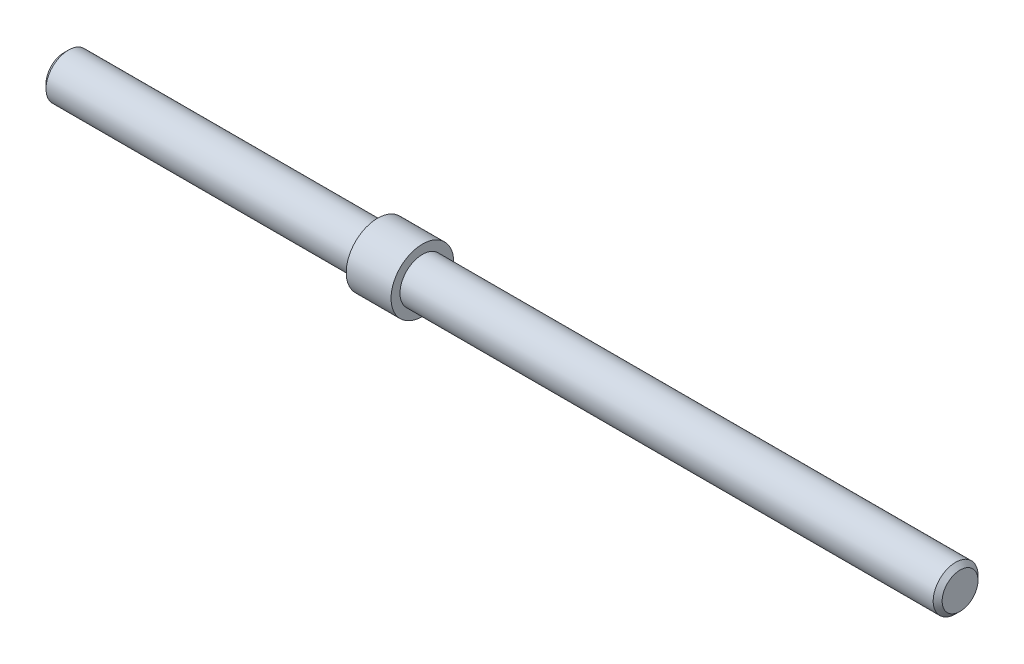
ISO-10303-21;
HEADER;
FILE_DESCRIPTION(('STEP AP214'),'2;1');
FILE_NAME('part.step','',(''),(''),'','','');
FILE_SCHEMA(('AUTOMOTIVE_DESIGN { 1 0 10303 214 1 1 1 1 }'));
ENDSEC;
DATA;
#1=APPLICATION_CONTEXT('core data for automotive mechanical design processes');
#2=APPLICATION_PROTOCOL_DEFINITION('international standard','automotive_design',2000,#1);
#3=PRODUCT_CONTEXT('',#1,'mechanical');
#4=PRODUCT('Part','Part','',(#3));
#5=PRODUCT_RELATED_PRODUCT_CATEGORY('part','',(#4));
#6=PRODUCT_DEFINITION_FORMATION('','',#4);
#7=PRODUCT_DEFINITION_CONTEXT('part definition',#1,'design');
#8=PRODUCT_DEFINITION('design','',#6,#7);
#9=PRODUCT_DEFINITION_SHAPE('','',#8);
#10=(LENGTH_UNIT() NAMED_UNIT(*) SI_UNIT(.MILLI.,.METRE.));
#11=(NAMED_UNIT(*) PLANE_ANGLE_UNIT() SI_UNIT($,.RADIAN.));
#12=(NAMED_UNIT(*) SI_UNIT($,.STERADIAN.) SOLID_ANGLE_UNIT());
#13=UNCERTAINTY_MEASURE_WITH_UNIT(LENGTH_MEASURE(1.E-05),#10,'distance_accuracy_value','');
#14=(GEOMETRIC_REPRESENTATION_CONTEXT(3) GLOBAL_UNCERTAINTY_ASSIGNED_CONTEXT((#13)) GLOBAL_UNIT_ASSIGNED_CONTEXT((#10,
#11,#12)) REPRESENTATION_CONTEXT('',''));
#15=CARTESIAN_POINT('',(0.,0.,0.));
#16=DIRECTION('',(0.,0.,1.));
#17=DIRECTION('',(1.,0.,0.));
#18=AXIS2_PLACEMENT_3D('',#15,#16,#17);
#19=CARTESIAN_POINT('',(200.,0.,0.));
#20=DIRECTION('',(-1.,0.,0.));
#21=DIRECTION('',(0.,0.,1.));
#22=AXIS2_PLACEMENT_3D('',#19,#20,#21);
#23=CYLINDRICAL_SURFACE('',#22,5.);
#24=CARTESIAN_POINT('',(80.,0.,0.));
#25=DIRECTION('',(1.,0.,0.));
#26=DIRECTION('',(0.,0.,-1.));
#27=AXIS2_PLACEMENT_3D('',#24,#25,#26);
#28=CIRCLE('',#27,5.);
#29=CARTESIAN_POINT('',(80.,0.,-5.));
#30=VERTEX_POINT('',#29);
#31=EDGE_CURVE('E42',#30,#30,#28,.T.);
#32=ORIENTED_EDGE('',*,*,#31,.T.);
#33=EDGE_LOOP('',(#32));
#34=FACE_BOUND('',#33,.T.);
#35=CARTESIAN_POINT('',(199.,0.,0.));
#36=DIRECTION('',(1.,0.,0.));
#37=DIRECTION('',(0.,0.,-1.));
#38=AXIS2_PLACEMENT_3D('',#35,#36,#37);
#39=CIRCLE('',#38,5.);
#40=CARTESIAN_POINT('',(199.,0.,-5.));
#41=VERTEX_POINT('',#40);
#42=EDGE_CURVE('E58',#41,#41,#39,.F.);
#43=ORIENTED_EDGE('',*,*,#42,.T.);
#44=EDGE_LOOP('',(#43));
#45=FACE_BOUND('',#44,.T.);
#46=ADVANCED_FACE('F37',(#34,#45),#23,.T.);
#47=CARTESIAN_POINT('',(200.,0.,0.));
#48=DIRECTION('',(1.,0.,0.));
#49=DIRECTION('',(0.,0.,-1.));
#50=AXIS2_PLACEMENT_3D('',#47,#48,#49);
#51=PLANE('',#50);
#52=CARTESIAN_POINT('',(200.,0.,0.));
#53=DIRECTION('',(1.,0.,0.));
#54=DIRECTION('',(0.,0.,-1.));
#55=AXIS2_PLACEMENT_3D('',#52,#53,#54);
#56=CIRCLE('',#55,4.);
#57=CARTESIAN_POINT('',(200.,0.,-4.));
#58=VERTEX_POINT('',#57);
#59=EDGE_CURVE('E46',#58,#58,#56,.T.);
#60=ORIENTED_EDGE('',*,*,#59,.T.);
#61=EDGE_LOOP('',(#60));
#62=FACE_BOUND('',#61,.T.);
#63=ADVANCED_FACE('F87',(#62),#51,.T.);
#64=CARTESIAN_POINT('',(200.,0.,0.));
#65=DIRECTION('',(-1.,0.,0.));
#66=DIRECTION('',(0.,0.,1.));
#67=AXIS2_PLACEMENT_3D('',#64,#65,#66);
#68=CONICAL_SURFACE('',#67,4.,0.78539816339746);
#69=ORIENTED_EDGE('',*,*,#42,.F.);
#70=EDGE_LOOP('',(#69));
#71=FACE_BOUND('',#70,.T.);
#72=ORIENTED_EDGE('',*,*,#59,.F.);
#73=EDGE_LOOP('',(#72));
#74=FACE_BOUND('',#73,.T.);
#75=ADVANCED_FACE('F40',(#71,#74),#68,.T.);
#76=CARTESIAN_POINT('',(80.,0.,0.));
#77=DIRECTION('',(-1.,0.,0.));
#78=DIRECTION('',(0.,0.,1.));
#79=AXIS2_PLACEMENT_3D('',#76,#77,#78);
#80=CYLINDRICAL_SURFACE('',#79,7.);
#81=CARTESIAN_POINT('',(80.,0.,0.));
#82=DIRECTION('',(1.,0.,0.));
#83=DIRECTION('',(0.,0.,-1.));
#84=AXIS2_PLACEMENT_3D('',#81,#82,#83);
#85=CIRCLE('',#84,7.);
#86=CARTESIAN_POINT('',(80.,0.,-7.));
#87=VERTEX_POINT('',#86);
#88=EDGE_CURVE('E64',#87,#87,#85,.T.);
#89=ORIENTED_EDGE('',*,*,#88,.F.);
#90=EDGE_LOOP('',(#89));
#91=FACE_BOUND('',#90,.T.);
#92=CARTESIAN_POINT('',(70.,0.,0.));
#93=DIRECTION('',(1.,0.,0.));
#94=DIRECTION('',(0.,0.,-1.));
#95=AXIS2_PLACEMENT_3D('',#92,#93,#94);
#96=CIRCLE('',#95,7.);
#97=CARTESIAN_POINT('',(70.,0.,-7.));
#98=VERTEX_POINT('',#97);
#99=EDGE_CURVE('E61',#98,#98,#96,.T.);
#100=ORIENTED_EDGE('',*,*,#99,.T.);
#101=EDGE_LOOP('',(#100));
#102=FACE_BOUND('',#101,.T.);
#103=ADVANCED_FACE('F76',(#91,#102),#80,.T.);
#104=CARTESIAN_POINT('',(80.,0.,0.));
#105=DIRECTION('',(1.,0.,0.));
#106=DIRECTION('',(0.,0.,-1.));
#107=AXIS2_PLACEMENT_3D('',#104,#105,#106);
#108=PLANE('',#107);
#109=ORIENTED_EDGE('',*,*,#31,.F.);
#110=EDGE_LOOP('',(#109));
#111=FACE_BOUND('',#110,.T.);
#112=ORIENTED_EDGE('',*,*,#88,.T.);
#113=EDGE_LOOP('',(#112));
#114=FACE_BOUND('',#113,.T.);
#115=ADVANCED_FACE('F73',(#111,#114),#108,.T.);
#116=CARTESIAN_POINT('',(70.,0.,0.));
#117=DIRECTION('',(1.,0.,0.));
#118=DIRECTION('',(0.,0.,-1.));
#119=AXIS2_PLACEMENT_3D('',#116,#117,#118);
#120=PLANE('',#119);
#121=CARTESIAN_POINT('',(70.,0.,0.));
#122=DIRECTION('',(1.,0.,0.));
#123=DIRECTION('',(0.,0.,-1.));
#124=AXIS2_PLACEMENT_3D('',#121,#122,#123);
#125=CIRCLE('',#124,5.);
#126=CARTESIAN_POINT('',(70.,0.,-5.));
#127=VERTEX_POINT('',#126);
#128=EDGE_CURVE('E10',#127,#127,#125,.T.);
#129=ORIENTED_EDGE('',*,*,#128,.T.);
#130=EDGE_LOOP('',(#129));
#131=FACE_BOUND('',#130,.T.);
#132=ORIENTED_EDGE('',*,*,#99,.F.);
#133=EDGE_LOOP('',(#132));
#134=FACE_BOUND('',#133,.T.);
#135=ADVANCED_FACE('F75',(#131,#134),#120,.F.);
#136=CARTESIAN_POINT('',(0.,0.,0.));
#137=DIRECTION('',(1.,0.,0.));
#138=DIRECTION('',(0.,0.,-1.));
#139=AXIS2_PLACEMENT_3D('',#136,#137,#138);
#140=PLANE('',#139);
#141=CARTESIAN_POINT('',(0.,0.,0.));
#142=DIRECTION('',(1.,0.,0.));
#143=DIRECTION('',(0.,0.,-1.));
#144=AXIS2_PLACEMENT_3D('',#141,#142,#143);
#145=CIRCLE('',#144,4.00000000000003);
#146=CARTESIAN_POINT('',(0.,0.,-4.00000000000003));
#147=VERTEX_POINT('',#146);
#148=EDGE_CURVE('E50',#147,#147,#145,.F.);
#149=ORIENTED_EDGE('',*,*,#148,.T.);
#150=EDGE_LOOP('',(#149));
#151=FACE_BOUND('',#150,.T.);
#152=ADVANCED_FACE('F82',(#151),#140,.F.);
#153=CARTESIAN_POINT('',(0.999999999999945,0.,0.));
#154=DIRECTION('',(1.,0.,0.));
#155=DIRECTION('',(0.,0.,-1.));
#156=AXIS2_PLACEMENT_3D('',#153,#154,#155);
#157=CONICAL_SURFACE('',#156,5.,0.78539816339746);
#158=ORIENTED_EDGE('',*,*,#148,.F.);
#159=EDGE_LOOP('',(#158));
#160=FACE_BOUND('',#159,.T.);
#161=CARTESIAN_POINT('',(0.999999999999945,0.,0.));
#162=DIRECTION('',(1.,0.,0.));
#163=DIRECTION('',(0.,0.,-1.));
#164=AXIS2_PLACEMENT_3D('',#161,#162,#163);
#165=CIRCLE('',#164,5.);
#166=CARTESIAN_POINT('',(0.999999999999945,0.,-5.));
#167=VERTEX_POINT('',#166);
#168=EDGE_CURVE('E55',#167,#167,#165,.T.);
#169=ORIENTED_EDGE('',*,*,#168,.F.);
#170=EDGE_LOOP('',(#169));
#171=FACE_BOUND('',#170,.T.);
#172=ADVANCED_FACE('F97',(#160,#171),#157,.T.);
#173=ORIENTED_EDGE('',*,*,#168,.T.);
#174=EDGE_LOOP('',(#173));
#175=FACE_BOUND('',#174,.T.);
#176=ORIENTED_EDGE('',*,*,#128,.F.);
#177=EDGE_LOOP('',(#176));
#178=FACE_BOUND('',#177,.T.);
#179=ADVANCED_FACE('F89',(#175,#178),#23,.T.);
#180=CLOSED_SHELL('',(#46,#63,#75,#103,#115,#135,#152,#172,#179));
#181=MANIFOLD_SOLID_BREP('B2',#180);
#182=ADVANCED_BREP_SHAPE_REPRESENTATION('',(#18,#181),#14);
#183=SHAPE_DEFINITION_REPRESENTATION(#9,#182);
ENDSEC;
END-ISO-10303-21;
